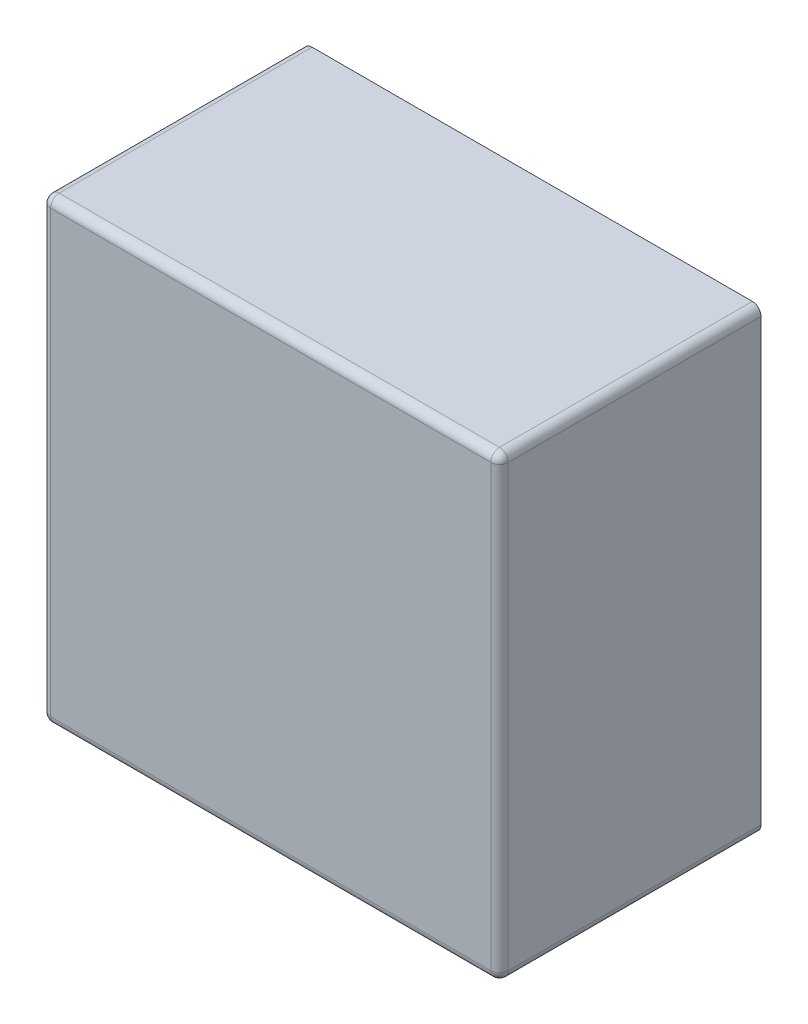
ISO-10303-21;
HEADER;
FILE_DESCRIPTION(('STEP AP214'),'2;1');
FILE_NAME('part.step','',(''),(''),'','','');
FILE_SCHEMA(('AUTOMOTIVE_DESIGN { 1 0 10303 214 1 1 1 1 }'));
ENDSEC;
DATA;
#1=APPLICATION_CONTEXT('core data for automotive mechanical design processes');
#2=APPLICATION_PROTOCOL_DEFINITION('international standard','automotive_design',2000,#1);
#3=PRODUCT_CONTEXT('',#1,'mechanical');
#4=PRODUCT('Part','Part','',(#3));
#5=PRODUCT_RELATED_PRODUCT_CATEGORY('part','',(#4));
#6=PRODUCT_DEFINITION_FORMATION('','',#4);
#7=PRODUCT_DEFINITION_CONTEXT('part definition',#1,'design');
#8=PRODUCT_DEFINITION('design','',#6,#7);
#9=PRODUCT_DEFINITION_SHAPE('','',#8);
#10=(LENGTH_UNIT() NAMED_UNIT(*) SI_UNIT(.MILLI.,.METRE.));
#11=(NAMED_UNIT(*) PLANE_ANGLE_UNIT() SI_UNIT($,.RADIAN.));
#12=(NAMED_UNIT(*) SI_UNIT($,.STERADIAN.) SOLID_ANGLE_UNIT());
#13=UNCERTAINTY_MEASURE_WITH_UNIT(LENGTH_MEASURE(1.E-05),#10,'distance_accuracy_value','');
#14=(GEOMETRIC_REPRESENTATION_CONTEXT(3) GLOBAL_UNCERTAINTY_ASSIGNED_CONTEXT((#13)) GLOBAL_UNIT_ASSIGNED_CONTEXT((#10,
#11,#12)) REPRESENTATION_CONTEXT('',''));
#15=CARTESIAN_POINT('',(0.,0.,0.));
#16=DIRECTION('',(0.,0.,1.));
#17=DIRECTION('',(1.,0.,0.));
#18=AXIS2_PLACEMENT_3D('',#15,#16,#17);
#19=CARTESIAN_POINT('',(0.,0.,60.));
#20=DIRECTION('',(1.,0.,0.));
#21=DIRECTION('',(0.,1.,0.));
#22=AXIS2_PLACEMENT_3D('',#19,#20,#21);
#23=PLANE('',#22);
#24=DIRECTION('',(0.,-1.,0.));
#25=VECTOR('',#24,1.);
#26=CARTESIAN_POINT('',(0.,0.,0.));
#27=LINE('',#26,#25);
#28=CARTESIAN_POINT('',(0.,-2.,0.));
#29=VERTEX_POINT('',#28);
#30=CARTESIAN_POINT('',(0.,-103.,0.));
#31=VERTEX_POINT('',#30);
#32=EDGE_CURVE('E142',#29,#31,#27,.T.);
#33=ORIENTED_EDGE('',*,*,#32,.T.);
#34=DIRECTION('',(0.,0.,-1.));
#35=VECTOR('',#34,1.);
#36=CARTESIAN_POINT('',(0.,-103.,60.));
#37=LINE('',#36,#35);
#38=CARTESIAN_POINT('',(0.,-103.,58.));
#39=VERTEX_POINT('',#38);
#40=EDGE_CURVE('E168',#31,#39,#37,.F.);
#41=ORIENTED_EDGE('',*,*,#40,.T.);
#42=DIRECTION('',(0.,-1.,0.));
#43=VECTOR('',#42,1.);
#44=CARTESIAN_POINT('',(0.,0.,58.));
#45=LINE('',#44,#43);
#46=CARTESIAN_POINT('',(0.,-2.,58.));
#47=VERTEX_POINT('',#46);
#48=EDGE_CURVE('E166',#39,#47,#45,.F.);
#49=ORIENTED_EDGE('',*,*,#48,.T.);
#50=DIRECTION('',(0.,0.,-1.));
#51=VECTOR('',#50,1.);
#52=CARTESIAN_POINT('',(0.,-2.,60.));
#53=LINE('',#52,#51);
#54=EDGE_CURVE('E164',#47,#29,#53,.T.);
#55=ORIENTED_EDGE('',*,*,#54,.T.);
#56=EDGE_LOOP('',(#33,#41,#49,#55));
#57=FACE_BOUND('',#56,.T.);
#58=ADVANCED_FACE('F33',(#57),#23,.F.);
#59=CARTESIAN_POINT('',(0.,-105.,60.));
#60=DIRECTION('',(0.,1.,0.));
#61=DIRECTION('',(0.,0.,1.));
#62=AXIS2_PLACEMENT_3D('',#59,#60,#61);
#63=PLANE('',#62);
#64=DIRECTION('',(1.,0.,0.));
#65=VECTOR('',#64,1.);
#66=CARTESIAN_POINT('',(0.,-105.,0.));
#67=LINE('',#66,#65);
#68=CARTESIAN_POINT('',(2.00000000000001,-105.,0.));
#69=VERTEX_POINT('',#68);
#70=CARTESIAN_POINT('',(103.,-105.,0.));
#71=VERTEX_POINT('',#70);
#72=EDGE_CURVE('E138',#69,#71,#67,.T.);
#73=ORIENTED_EDGE('',*,*,#72,.T.);
#74=DIRECTION('',(0.,0.,-1.));
#75=VECTOR('',#74,1.);
#76=CARTESIAN_POINT('',(103.,-105.,60.));
#77=LINE('',#76,#75);
#78=CARTESIAN_POINT('',(103.,-105.,58.));
#79=VERTEX_POINT('',#78);
#80=EDGE_CURVE('E115',#71,#79,#77,.F.);
#81=ORIENTED_EDGE('',*,*,#80,.T.);
#82=DIRECTION('',(1.,0.,0.));
#83=VECTOR('',#82,1.);
#84=CARTESIAN_POINT('',(0.,-105.,58.));
#85=LINE('',#84,#83);
#86=CARTESIAN_POINT('',(2.00000000000001,-105.,58.));
#87=VERTEX_POINT('',#86);
#88=EDGE_CURVE('E152',#79,#87,#85,.F.);
#89=ORIENTED_EDGE('',*,*,#88,.T.);
#90=DIRECTION('',(0.,0.,-1.));
#91=VECTOR('',#90,1.);
#92=CARTESIAN_POINT('',(2.00000000000001,-105.,60.));
#93=LINE('',#92,#91);
#94=EDGE_CURVE('E120',#87,#69,#93,.T.);
#95=ORIENTED_EDGE('',*,*,#94,.T.);
#96=EDGE_LOOP('',(#73,#81,#89,#95));
#97=FACE_BOUND('',#96,.T.);
#98=ADVANCED_FACE('F248',(#97),#63,.F.);
#99=CARTESIAN_POINT('',(105.,0.,60.));
#100=DIRECTION('',(-1.,0.,0.));
#101=DIRECTION('',(0.,-1.,0.));
#102=AXIS2_PLACEMENT_3D('',#99,#100,#101);
#103=PLANE('',#102);
#104=DIRECTION('',(0.,1.,0.));
#105=VECTOR('',#104,1.);
#106=CARTESIAN_POINT('',(105.,-105.,58.));
#107=LINE('',#106,#105);
#108=CARTESIAN_POINT('',(105.,-2.,58.));
#109=VERTEX_POINT('',#108);
#110=CARTESIAN_POINT('',(105.,-103.,58.));
#111=VERTEX_POINT('',#110);
#112=EDGE_CURVE('E129',#109,#111,#107,.F.);
#113=ORIENTED_EDGE('',*,*,#112,.T.);
#114=DIRECTION('',(0.,0.,-1.));
#115=VECTOR('',#114,1.);
#116=CARTESIAN_POINT('',(105.,-103.,60.));
#117=LINE('',#116,#115);
#118=CARTESIAN_POINT('',(105.,-103.,0.));
#119=VERTEX_POINT('',#118);
#120=EDGE_CURVE('E114',#111,#119,#117,.T.);
#121=ORIENTED_EDGE('',*,*,#120,.T.);
#122=DIRECTION('',(0.,1.,0.));
#123=VECTOR('',#122,1.);
#124=CARTESIAN_POINT('',(105.,0.,0.));
#125=LINE('',#124,#123);
#126=CARTESIAN_POINT('',(105.,-2.,0.));
#127=VERTEX_POINT('',#126);
#128=EDGE_CURVE('E126',#119,#127,#125,.T.);
#129=ORIENTED_EDGE('',*,*,#128,.T.);
#130=DIRECTION('',(0.,0.,-1.));
#131=VECTOR('',#130,1.);
#132=CARTESIAN_POINT('',(105.,-2.,60.));
#133=LINE('',#132,#131);
#134=EDGE_CURVE('E140',#127,#109,#133,.F.);
#135=ORIENTED_EDGE('',*,*,#134,.T.);
#136=EDGE_LOOP('',(#113,#121,#129,#135));
#137=FACE_BOUND('',#136,.T.);
#138=ADVANCED_FACE('F125',(#137),#103,.F.);
#139=CARTESIAN_POINT('',(0.,0.,60.));
#140=DIRECTION('',(0.,-1.,0.));
#141=DIRECTION('',(0.,0.,-1.));
#142=AXIS2_PLACEMENT_3D('',#139,#140,#141);
#143=PLANE('',#142);
#144=DIRECTION('',(-1.,0.,0.));
#145=VECTOR('',#144,1.);
#146=CARTESIAN_POINT('',(105.,0.,58.));
#147=LINE('',#146,#145);
#148=CARTESIAN_POINT('',(2.,0.,58.));
#149=VERTEX_POINT('',#148);
#150=CARTESIAN_POINT('',(103.,0.,58.));
#151=VERTEX_POINT('',#150);
#152=EDGE_CURVE('E49',#149,#151,#147,.F.);
#153=ORIENTED_EDGE('',*,*,#152,.T.);
#154=DIRECTION('',(0.,0.,-1.));
#155=VECTOR('',#154,1.);
#156=CARTESIAN_POINT('',(103.,0.,60.));
#157=LINE('',#156,#155);
#158=CARTESIAN_POINT('',(103.,0.,0.));
#159=VERTEX_POINT('',#158);
#160=EDGE_CURVE('E11',#151,#159,#157,.T.);
#161=ORIENTED_EDGE('',*,*,#160,.T.);
#162=DIRECTION('',(-1.,0.,0.));
#163=VECTOR('',#162,1.);
#164=CARTESIAN_POINT('',(0.,0.,0.));
#165=LINE('',#164,#163);
#166=CARTESIAN_POINT('',(2.,0.,0.));
#167=VERTEX_POINT('',#166);
#168=EDGE_CURVE('E137',#159,#167,#165,.T.);
#169=ORIENTED_EDGE('',*,*,#168,.T.);
#170=DIRECTION('',(0.,0.,-1.));
#171=VECTOR('',#170,1.);
#172=CARTESIAN_POINT('',(2.,0.,60.));
#173=LINE('',#172,#171);
#174=EDGE_CURVE('E42',#167,#149,#173,.F.);
#175=ORIENTED_EDGE('',*,*,#174,.T.);
#176=EDGE_LOOP('',(#153,#161,#169,#175));
#177=FACE_BOUND('',#176,.T.);
#178=ADVANCED_FACE('F226',(#177),#143,.F.);
#179=CARTESIAN_POINT('',(0.,0.,60.));
#180=DIRECTION('',(0.,0.,1.));
#181=DIRECTION('',(1.,0.,0.));
#182=AXIS2_PLACEMENT_3D('',#179,#180,#181);
#183=PLANE('',#182);
#184=DIRECTION('',(0.,-1.,0.));
#185=VECTOR('',#184,1.);
#186=CARTESIAN_POINT('',(2.00000000000001,-105.,60.));
#187=LINE('',#186,#185);
#188=CARTESIAN_POINT('',(2.,-2.,60.));
#189=VERTEX_POINT('',#188);
#190=CARTESIAN_POINT('',(2.00000000000001,-103.,60.));
#191=VERTEX_POINT('',#190);
#192=EDGE_CURVE('E157',#189,#191,#187,.T.);
#193=ORIENTED_EDGE('',*,*,#192,.T.);
#194=DIRECTION('',(1.,0.,0.));
#195=VECTOR('',#194,1.);
#196=CARTESIAN_POINT('',(105.,-103.,60.));
#197=LINE('',#196,#195);
#198=CARTESIAN_POINT('',(103.,-103.,60.));
#199=VERTEX_POINT('',#198);
#200=EDGE_CURVE('E161',#191,#199,#197,.T.);
#201=ORIENTED_EDGE('',*,*,#200,.T.);
#202=DIRECTION('',(0.,1.,0.));
#203=VECTOR('',#202,1.);
#204=CARTESIAN_POINT('',(103.,0.,60.));
#205=LINE('',#204,#203);
#206=CARTESIAN_POINT('',(103.,-2.,60.));
#207=VERTEX_POINT('',#206);
#208=EDGE_CURVE('E159',#199,#207,#205,.T.);
#209=ORIENTED_EDGE('',*,*,#208,.T.);
#210=DIRECTION('',(-1.,0.,0.));
#211=VECTOR('',#210,1.);
#212=CARTESIAN_POINT('',(0.,-2.,60.));
#213=LINE('',#212,#211);
#214=EDGE_CURVE('E155',#207,#189,#213,.T.);
#215=ORIENTED_EDGE('',*,*,#214,.T.);
#216=EDGE_LOOP('',(#193,#201,#209,#215));
#217=FACE_BOUND('',#216,.T.);
#218=ADVANCED_FACE('F286',(#217),#183,.T.);
#219=CARTESIAN_POINT('',(0.,0.,0.));
#220=DIRECTION('',(0.,0.,1.));
#221=DIRECTION('',(1.,0.,0.));
#222=AXIS2_PLACEMENT_3D('',#219,#220,#221);
#223=PLANE('',#222);
#224=ORIENTED_EDGE('',*,*,#128,.F.);
#225=CARTESIAN_POINT('',(103.,-103.,0.));
#226=DIRECTION('',(0.,0.,1.));
#227=DIRECTION('',(1.,0.,0.));
#228=AXIS2_PLACEMENT_3D('',#225,#226,#227);
#229=CIRCLE('',#228,2.);
#230=EDGE_CURVE('E110',#119,#71,#229,.F.);
#231=ORIENTED_EDGE('',*,*,#230,.T.);
#232=ORIENTED_EDGE('',*,*,#72,.F.);
#233=CARTESIAN_POINT('',(2.00000000000001,-103.,0.));
#234=DIRECTION('',(0.,0.,1.));
#235=DIRECTION('',(1.,0.,0.));
#236=AXIS2_PLACEMENT_3D('',#233,#234,#235);
#237=CIRCLE('',#236,2.);
#238=EDGE_CURVE('E121',#69,#31,#237,.F.);
#239=ORIENTED_EDGE('',*,*,#238,.T.);
#240=ORIENTED_EDGE('',*,*,#32,.F.);
#241=CARTESIAN_POINT('',(2.,-2.,0.));
#242=DIRECTION('',(0.,0.,1.));
#243=DIRECTION('',(1.,0.,0.));
#244=AXIS2_PLACEMENT_3D('',#241,#242,#243);
#245=CIRCLE('',#244,2.);
#246=EDGE_CURVE('E131',#29,#167,#245,.F.);
#247=ORIENTED_EDGE('',*,*,#246,.T.);
#248=ORIENTED_EDGE('',*,*,#168,.F.);
#249=CARTESIAN_POINT('',(103.,-2.,0.));
#250=DIRECTION('',(0.,0.,1.));
#251=DIRECTION('',(1.,0.,0.));
#252=AXIS2_PLACEMENT_3D('',#249,#250,#251);
#253=CIRCLE('',#252,2.);
#254=EDGE_CURVE('E136',#159,#127,#253,.F.);
#255=ORIENTED_EDGE('',*,*,#254,.T.);
#256=EDGE_LOOP('',(#224,#231,#232,#239,#240,#247,#248,#255));
#257=FACE_BOUND('',#256,.T.);
#258=ADVANCED_FACE('F133',(#257),#223,.F.);
#259=CARTESIAN_POINT('',(2.,-2.,60.));
#260=DIRECTION('',(0.,0.,-1.));
#261=DIRECTION('',(-1.,0.,0.));
#262=AXIS2_PLACEMENT_3D('',#259,#260,#261);
#263=CYLINDRICAL_SURFACE('',#262,2.);
#264=CARTESIAN_POINT('',(2.,-2.,58.));
#265=DIRECTION('',(0.,0.,1.));
#266=DIRECTION('',(1.,0.,0.));
#267=AXIS2_PLACEMENT_3D('',#264,#265,#266);
#268=CIRCLE('',#267,2.);
#269=EDGE_CURVE('E37',#149,#47,#268,.T.);
#270=ORIENTED_EDGE('',*,*,#269,.F.);
#271=ORIENTED_EDGE('',*,*,#174,.F.);
#272=ORIENTED_EDGE('',*,*,#246,.F.);
#273=ORIENTED_EDGE('',*,*,#54,.F.);
#274=EDGE_LOOP('',(#270,#271,#272,#273));
#275=FACE_BOUND('',#274,.T.);
#276=ADVANCED_FACE('F35',(#275),#263,.T.);
#277=CARTESIAN_POINT('',(2.,-2.,58.));
#278=DIRECTION('',(0.,0.,1.));
#279=DIRECTION('',(1.,0.,0.));
#280=AXIS2_PLACEMENT_3D('',#277,#278,#279);
#281=SPHERICAL_SURFACE('',#280,2.);
#282=CARTESIAN_POINT('',(2.,-2.,58.));
#283=DIRECTION('',(-1.,0.,0.));
#284=DIRECTION('',(0.,0.,1.));
#285=AXIS2_PLACEMENT_3D('',#282,#283,#284);
#286=CIRCLE('',#285,2.);
#287=EDGE_CURVE('E197',#149,#189,#286,.F.);
#288=ORIENTED_EDGE('',*,*,#287,.F.);
#289=ORIENTED_EDGE('',*,*,#269,.T.);
#290=CARTESIAN_POINT('',(2.,-2.,58.));
#291=DIRECTION('',(0.,1.,0.));
#292=DIRECTION('',(-1.,0.,0.));
#293=AXIS2_PLACEMENT_3D('',#290,#291,#292);
#294=CIRCLE('',#293,2.);
#295=EDGE_CURVE('E199',#189,#47,#294,.F.);
#296=ORIENTED_EDGE('',*,*,#295,.F.);
#297=EDGE_LOOP('',(#288,#289,#296));
#298=FACE_BOUND('',#297,.T.);
#299=ADVANCED_FACE('F278',(#298),#281,.T.);
#300=CARTESIAN_POINT('',(2.00000000000001,-103.,60.));
#301=DIRECTION('',(0.,0.,-1.));
#302=DIRECTION('',(-1.,0.,0.));
#303=AXIS2_PLACEMENT_3D('',#300,#301,#302);
#304=CYLINDRICAL_SURFACE('',#303,2.);
#305=ORIENTED_EDGE('',*,*,#238,.F.);
#306=ORIENTED_EDGE('',*,*,#94,.F.);
#307=CARTESIAN_POINT('',(2.00000000000001,-103.,58.));
#308=DIRECTION('',(0.,0.,1.));
#309=DIRECTION('',(1.,0.,0.));
#310=AXIS2_PLACEMENT_3D('',#307,#308,#309);
#311=CIRCLE('',#310,2.);
#312=EDGE_CURVE('E194',#39,#87,#311,.T.);
#313=ORIENTED_EDGE('',*,*,#312,.F.);
#314=ORIENTED_EDGE('',*,*,#40,.F.);
#315=EDGE_LOOP('',(#305,#306,#313,#314));
#316=FACE_BOUND('',#315,.T.);
#317=ADVANCED_FACE('F217',(#316),#304,.T.);
#318=CARTESIAN_POINT('',(2.,0.,58.));
#319=DIRECTION('',(0.,1.,0.));
#320=DIRECTION('',(-1.,0.,0.));
#321=AXIS2_PLACEMENT_3D('',#318,#319,#320);
#322=CYLINDRICAL_SURFACE('',#321,2.);
#323=ORIENTED_EDGE('',*,*,#295,.T.);
#324=ORIENTED_EDGE('',*,*,#48,.F.);
#325=CARTESIAN_POINT('',(2.00000000000001,-103.,58.));
#326=DIRECTION('',(0.,-1.,0.));
#327=DIRECTION('',(0.,0.,-1.));
#328=AXIS2_PLACEMENT_3D('',#325,#326,#327);
#329=CIRCLE('',#328,2.);
#330=EDGE_CURVE('E191',#191,#39,#329,.T.);
#331=ORIENTED_EDGE('',*,*,#330,.F.);
#332=ORIENTED_EDGE('',*,*,#192,.F.);
#333=EDGE_LOOP('',(#323,#324,#331,#332));
#334=FACE_BOUND('',#333,.T.);
#335=ADVANCED_FACE('F224',(#334),#322,.T.);
#336=CARTESIAN_POINT('',(0.,-2.,58.));
#337=DIRECTION('',(1.,0.,0.));
#338=DIRECTION('',(0.,0.,-1.));
#339=AXIS2_PLACEMENT_3D('',#336,#337,#338);
#340=CYLINDRICAL_SURFACE('',#339,2.);
#341=ORIENTED_EDGE('',*,*,#287,.T.);
#342=ORIENTED_EDGE('',*,*,#214,.F.);
#343=CARTESIAN_POINT('',(103.,-2.,58.));
#344=DIRECTION('',(1.,0.,0.));
#345=DIRECTION('',(0.,0.,-1.));
#346=AXIS2_PLACEMENT_3D('',#343,#344,#345);
#347=CIRCLE('',#346,2.);
#348=EDGE_CURVE('E188',#151,#207,#347,.T.);
#349=ORIENTED_EDGE('',*,*,#348,.F.);
#350=ORIENTED_EDGE('',*,*,#152,.F.);
#351=EDGE_LOOP('',(#341,#342,#349,#350));
#352=FACE_BOUND('',#351,.T.);
#353=ADVANCED_FACE('F234',(#352),#340,.T.);
#354=CARTESIAN_POINT('',(103.,-2.,60.));
#355=DIRECTION('',(0.,0.,-1.));
#356=DIRECTION('',(-1.,0.,0.));
#357=AXIS2_PLACEMENT_3D('',#354,#355,#356);
#358=CYLINDRICAL_SURFACE('',#357,2.);
#359=ORIENTED_EDGE('',*,*,#254,.F.);
#360=ORIENTED_EDGE('',*,*,#160,.F.);
#361=CARTESIAN_POINT('',(103.,-2.,58.));
#362=DIRECTION('',(0.,0.,1.));
#363=DIRECTION('',(1.,0.,0.));
#364=AXIS2_PLACEMENT_3D('',#361,#362,#363);
#365=CIRCLE('',#364,2.);
#366=EDGE_CURVE('E185',#109,#151,#365,.T.);
#367=ORIENTED_EDGE('',*,*,#366,.F.);
#368=ORIENTED_EDGE('',*,*,#134,.F.);
#369=EDGE_LOOP('',(#359,#360,#367,#368));
#370=FACE_BOUND('',#369,.T.);
#371=ADVANCED_FACE('F230',(#370),#358,.T.);
#372=CARTESIAN_POINT('',(2.00000000000001,-103.,58.));
#373=DIRECTION('',(0.,0.,1.));
#374=DIRECTION('',(1.,0.,0.));
#375=AXIS2_PLACEMENT_3D('',#372,#373,#374);
#376=SPHERICAL_SURFACE('',#375,2.);
#377=ORIENTED_EDGE('',*,*,#330,.T.);
#378=ORIENTED_EDGE('',*,*,#312,.T.);
#379=CARTESIAN_POINT('',(2.00000000000001,-103.,58.));
#380=DIRECTION('',(-1.,0.,0.));
#381=DIRECTION('',(0.,0.,1.));
#382=AXIS2_PLACEMENT_3D('',#379,#380,#381);
#383=CIRCLE('',#382,2.);
#384=EDGE_CURVE('E182',#191,#87,#383,.F.);
#385=ORIENTED_EDGE('',*,*,#384,.F.);
#386=EDGE_LOOP('',(#377,#378,#385));
#387=FACE_BOUND('',#386,.T.);
#388=ADVANCED_FACE('F222',(#387),#376,.T.);
#389=CARTESIAN_POINT('',(103.,-2.,58.));
#390=DIRECTION('',(0.,0.,1.));
#391=DIRECTION('',(1.,0.,0.));
#392=AXIS2_PLACEMENT_3D('',#389,#390,#391);
#393=SPHERICAL_SURFACE('',#392,2.);
#394=ORIENTED_EDGE('',*,*,#366,.T.);
#395=ORIENTED_EDGE('',*,*,#348,.T.);
#396=CARTESIAN_POINT('',(103.,-2.,58.));
#397=DIRECTION('',(0.,1.,0.));
#398=DIRECTION('',(-1.,0.,0.));
#399=AXIS2_PLACEMENT_3D('',#396,#397,#398);
#400=CIRCLE('',#399,2.);
#401=EDGE_CURVE('E179',#109,#207,#400,.F.);
#402=ORIENTED_EDGE('',*,*,#401,.F.);
#403=EDGE_LOOP('',(#394,#395,#402));
#404=FACE_BOUND('',#403,.T.);
#405=ADVANCED_FACE('F236',(#404),#393,.T.);
#406=CARTESIAN_POINT('',(0.,-103.,58.));
#407=DIRECTION('',(-1.,0.,0.));
#408=DIRECTION('',(0.,0.,1.));
#409=AXIS2_PLACEMENT_3D('',#406,#407,#408);
#410=CYLINDRICAL_SURFACE('',#409,2.);
#411=ORIENTED_EDGE('',*,*,#384,.T.);
#412=ORIENTED_EDGE('',*,*,#88,.F.);
#413=CARTESIAN_POINT('',(103.,-103.,58.));
#414=DIRECTION('',(1.,0.,0.));
#415=DIRECTION('',(0.,0.,-1.));
#416=AXIS2_PLACEMENT_3D('',#413,#414,#415);
#417=CIRCLE('',#416,2.);
#418=EDGE_CURVE('E176',#199,#79,#417,.T.);
#419=ORIENTED_EDGE('',*,*,#418,.F.);
#420=ORIENTED_EDGE('',*,*,#200,.F.);
#421=EDGE_LOOP('',(#411,#412,#419,#420));
#422=FACE_BOUND('',#421,.T.);
#423=ADVANCED_FACE('F246',(#422),#410,.T.);
#424=CARTESIAN_POINT('',(103.,0.,58.));
#425=DIRECTION('',(0.,-1.,0.));
#426=DIRECTION('',(1.,0.,0.));
#427=AXIS2_PLACEMENT_3D('',#424,#425,#426);
#428=CYLINDRICAL_SURFACE('',#427,2.);
#429=ORIENTED_EDGE('',*,*,#401,.T.);
#430=ORIENTED_EDGE('',*,*,#208,.F.);
#431=CARTESIAN_POINT('',(103.,-103.,58.));
#432=DIRECTION('',(0.,-1.,0.));
#433=DIRECTION('',(0.,0.,-1.));
#434=AXIS2_PLACEMENT_3D('',#431,#432,#433);
#435=CIRCLE('',#434,2.);
#436=EDGE_CURVE('E174',#111,#199,#435,.T.);
#437=ORIENTED_EDGE('',*,*,#436,.F.);
#438=ORIENTED_EDGE('',*,*,#112,.F.);
#439=EDGE_LOOP('',(#429,#430,#437,#438));
#440=FACE_BOUND('',#439,.T.);
#441=ADVANCED_FACE('F239',(#440),#428,.T.);
#442=CARTESIAN_POINT('',(103.,-103.,58.));
#443=DIRECTION('',(0.,0.,1.));
#444=DIRECTION('',(1.,0.,0.));
#445=AXIS2_PLACEMENT_3D('',#442,#443,#444);
#446=SPHERICAL_SURFACE('',#445,2.);
#447=ORIENTED_EDGE('',*,*,#436,.T.);
#448=ORIENTED_EDGE('',*,*,#418,.T.);
#449=CARTESIAN_POINT('',(103.,-103.,58.));
#450=DIRECTION('',(0.,0.,1.));
#451=DIRECTION('',(1.,0.,0.));
#452=AXIS2_PLACEMENT_3D('',#449,#450,#451);
#453=CIRCLE('',#452,2.);
#454=EDGE_CURVE('E172',#111,#79,#453,.F.);
#455=ORIENTED_EDGE('',*,*,#454,.F.);
#456=EDGE_LOOP('',(#447,#448,#455));
#457=FACE_BOUND('',#456,.T.);
#458=ADVANCED_FACE('F243',(#457),#446,.T.);
#459=CARTESIAN_POINT('',(103.,-103.,60.));
#460=DIRECTION('',(0.,0.,-1.));
#461=DIRECTION('',(-1.,0.,0.));
#462=AXIS2_PLACEMENT_3D('',#459,#460,#461);
#463=CYLINDRICAL_SURFACE('',#462,2.);
#464=ORIENTED_EDGE('',*,*,#454,.T.);
#465=ORIENTED_EDGE('',*,*,#80,.F.);
#466=ORIENTED_EDGE('',*,*,#230,.F.);
#467=ORIENTED_EDGE('',*,*,#120,.F.);
#468=EDGE_LOOP('',(#464,#465,#466,#467));
#469=FACE_BOUND('',#468,.T.);
#470=ADVANCED_FACE('F113',(#469),#463,.T.);
#471=CLOSED_SHELL('',(#58,#98,#138,#178,#218,#258,#276,#299,#317,#335,#353,#371,#388,#405,#423,
#441,#458,#470));
#472=MANIFOLD_SOLID_BREP('B2',#471);
#473=ADVANCED_BREP_SHAPE_REPRESENTATION('',(#18,#472),#14);
#474=SHAPE_DEFINITION_REPRESENTATION(#9,#473);
ENDSEC;
END-ISO-10303-21;
